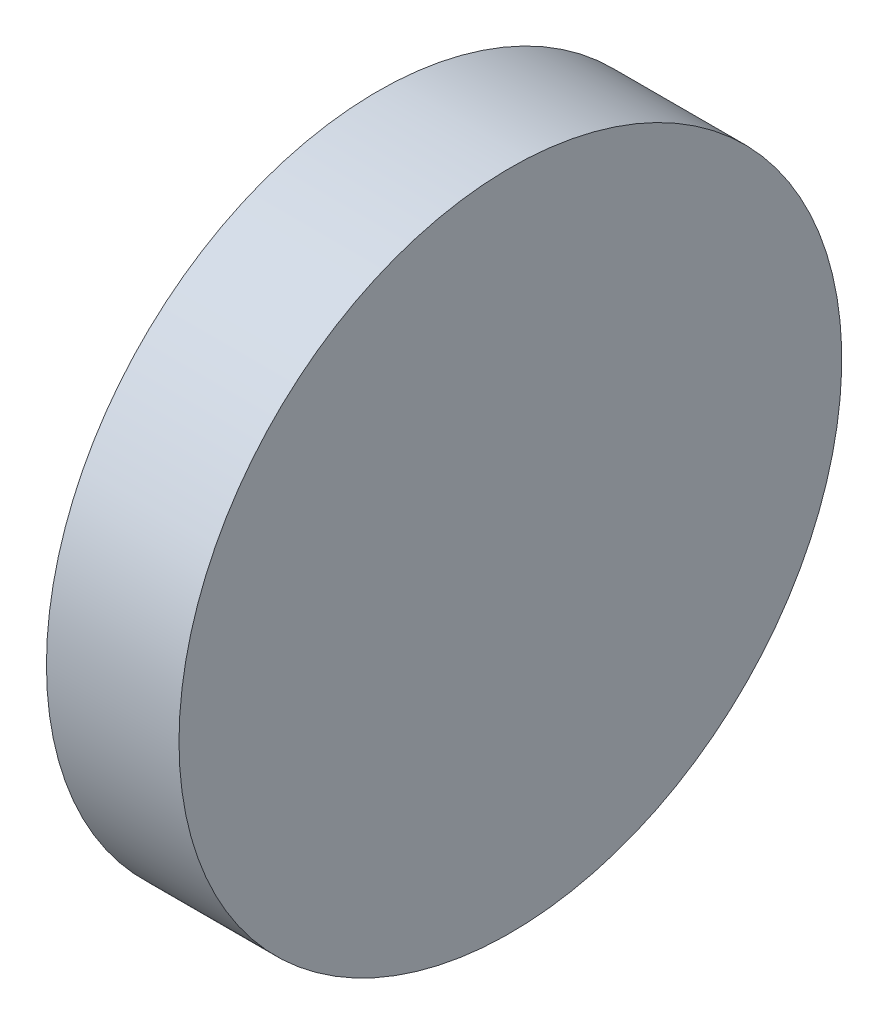
ISO-10303-21;
HEADER;
FILE_DESCRIPTION(('STEP AP214'),'2;1');
FILE_NAME('part.step','',(''),(''),'','','');
FILE_SCHEMA(('AUTOMOTIVE_DESIGN { 1 0 10303 214 1 1 1 1 }'));
ENDSEC;
DATA;
#1=APPLICATION_CONTEXT('core data for automotive mechanical design processes');
#2=APPLICATION_PROTOCOL_DEFINITION('international standard','automotive_design',2000,#1);
#3=PRODUCT_CONTEXT('',#1,'mechanical');
#4=PRODUCT('Part','Part','',(#3));
#5=PRODUCT_RELATED_PRODUCT_CATEGORY('part','',(#4));
#6=PRODUCT_DEFINITION_FORMATION('','',#4);
#7=PRODUCT_DEFINITION_CONTEXT('part definition',#1,'design');
#8=PRODUCT_DEFINITION('design','',#6,#7);
#9=PRODUCT_DEFINITION_SHAPE('','',#8);
#10=(LENGTH_UNIT() NAMED_UNIT(*) SI_UNIT(.MILLI.,.METRE.));
#11=(NAMED_UNIT(*) PLANE_ANGLE_UNIT() SI_UNIT($,.RADIAN.));
#12=(NAMED_UNIT(*) SI_UNIT($,.STERADIAN.) SOLID_ANGLE_UNIT());
#13=UNCERTAINTY_MEASURE_WITH_UNIT(LENGTH_MEASURE(1.E-05),#10,'distance_accuracy_value','');
#14=(GEOMETRIC_REPRESENTATION_CONTEXT(3) GLOBAL_UNCERTAINTY_ASSIGNED_CONTEXT((#13)) GLOBAL_UNIT_ASSIGNED_CONTEXT((#10,
#11,#12)) REPRESENTATION_CONTEXT('',''));
#15=CARTESIAN_POINT('',(0.,0.,0.));
#16=DIRECTION('',(0.,0.,1.));
#17=DIRECTION('',(1.,0.,0.));
#18=AXIS2_PLACEMENT_3D('',#15,#16,#17);
#19=CARTESIAN_POINT('',(106.062856197024,30.9172717396062,0.));
#20=DIRECTION('',(-1.,0.,0.));
#21=DIRECTION('',(0.,0.,1.));
#22=AXIS2_PLACEMENT_3D('',#19,#20,#21);
#23=PLANE('',#22);
#24=CARTESIAN_POINT('',(106.062856197024,30.9172717396062,0.));
#25=DIRECTION('',(-1.,0.,0.));
#26=DIRECTION('',(0.,0.,1.));
#27=AXIS2_PLACEMENT_3D('',#24,#25,#26);
#28=CIRCLE('',#27,4.99999999999999);
#29=CARTESIAN_POINT('',(106.062856197024,30.9172717396062,4.99999999999999));
#30=VERTEX_POINT('',#29);
#31=EDGE_CURVE('E10',#30,#30,#28,.T.);
#32=ORIENTED_EDGE('',*,*,#31,.F.);
#33=EDGE_LOOP('',(#32));
#34=FACE_BOUND('',#33,.T.);
#35=ADVANCED_FACE('F35',(#34),#23,.F.);
#36=CARTESIAN_POINT('',(101.600320797046,30.9172717396062,0.));
#37=DIRECTION('',(-1.,0.,0.));
#38=DIRECTION('',(0.,0.,1.));
#39=AXIS2_PLACEMENT_3D('',#36,#37,#38);
#40=CYLINDRICAL_SURFACE('',#39,4.99999999999999);
#41=CARTESIAN_POINT('',(104.062856197024,30.9172717396062,0.));
#42=DIRECTION('',(-1.,0.,0.));
#43=DIRECTION('',(0.,0.,1.));
#44=AXIS2_PLACEMENT_3D('',#41,#42,#43);
#45=CIRCLE('',#44,4.99999999999999);
#46=CARTESIAN_POINT('',(104.062856197024,30.9172717396062,4.99999999999999));
#47=VERTEX_POINT('',#46);
#48=EDGE_CURVE('E41',#47,#47,#45,.T.);
#49=ORIENTED_EDGE('',*,*,#48,.F.);
#50=EDGE_LOOP('',(#49));
#51=FACE_BOUND('',#50,.T.);
#52=ORIENTED_EDGE('',*,*,#31,.T.);
#53=EDGE_LOOP('',(#52));
#54=FACE_BOUND('',#53,.T.);
#55=ADVANCED_FACE('F49',(#51,#54),#40,.T.);
#56=CARTESIAN_POINT('',(104.062856197024,30.9172717396062,0.));
#57=DIRECTION('',(1.,0.,0.));
#58=DIRECTION('',(0.,0.,-1.));
#59=AXIS2_PLACEMENT_3D('',#56,#57,#58);
#60=PLANE('',#59);
#61=ORIENTED_EDGE('',*,*,#48,.T.);
#62=EDGE_LOOP('',(#61));
#63=FACE_BOUND('',#62,.T.);
#64=ADVANCED_FACE('F47',(#63),#60,.F.);
#65=CLOSED_SHELL('',(#35,#55,#64));
#66=MANIFOLD_SOLID_BREP('B2',#65);
#67=ADVANCED_BREP_SHAPE_REPRESENTATION('',(#18,#66),#14);
#68=SHAPE_DEFINITION_REPRESENTATION(#9,#67);
ENDSEC;
END-ISO-10303-21;
